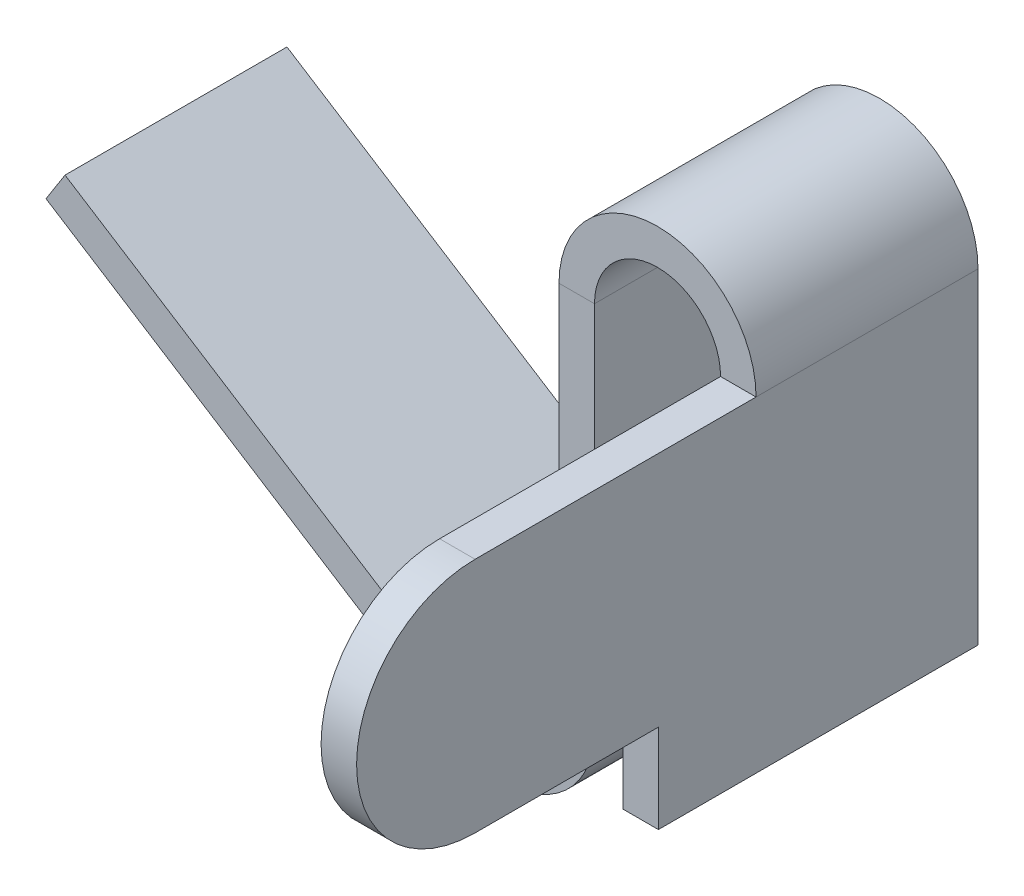
ISO-10303-21;
HEADER;
FILE_DESCRIPTION(('STEP AP214'),'2;1');
FILE_NAME('part.step','',(''),(''),'','','');
FILE_SCHEMA(('AUTOMOTIVE_DESIGN { 1 0 10303 214 1 1 1 1 }'));
ENDSEC;
DATA;
#1=APPLICATION_CONTEXT('core data for automotive mechanical design processes');
#2=APPLICATION_PROTOCOL_DEFINITION('international standard','automotive_design',2000,#1);
#3=PRODUCT_CONTEXT('',#1,'mechanical');
#4=PRODUCT('Part','Part','',(#3));
#5=PRODUCT_RELATED_PRODUCT_CATEGORY('part','',(#4));
#6=PRODUCT_DEFINITION_FORMATION('','',#4);
#7=PRODUCT_DEFINITION_CONTEXT('part definition',#1,'design');
#8=PRODUCT_DEFINITION('design','',#6,#7);
#9=PRODUCT_DEFINITION_SHAPE('','',#8);
#10=(LENGTH_UNIT() NAMED_UNIT(*) SI_UNIT(.MILLI.,.METRE.));
#11=(NAMED_UNIT(*) PLANE_ANGLE_UNIT() SI_UNIT($,.RADIAN.));
#12=(NAMED_UNIT(*) SI_UNIT($,.STERADIAN.) SOLID_ANGLE_UNIT());
#13=UNCERTAINTY_MEASURE_WITH_UNIT(LENGTH_MEASURE(1.E-05),#10,'distance_accuracy_value','');
#14=(GEOMETRIC_REPRESENTATION_CONTEXT(3) GLOBAL_UNCERTAINTY_ASSIGNED_CONTEXT((#13)) GLOBAL_UNIT_ASSIGNED_CONTEXT((#10,
#11,#12)) REPRESENTATION_CONTEXT('',''));
#15=CARTESIAN_POINT('',(0.,0.,0.));
#16=DIRECTION('',(0.,0.,1.));
#17=DIRECTION('',(1.,0.,0.));
#18=AXIS2_PLACEMENT_3D('',#15,#16,#17);
#19=CARTESIAN_POINT('',(1.11,0.5,5.665));
#20=DIRECTION('',(-1.,0.,0.));
#21=DIRECTION('',(0.,-1.,0.));
#22=AXIS2_PLACEMENT_3D('',#19,#20,#21);
#23=CYLINDRICAL_SURFACE('',#22,1.335);
#24=DIRECTION('',(1.,0.,0.));
#25=VECTOR('',#24,1.);
#26=CARTESIAN_POINT('',(1.11,-0.835,5.665));
#27=LINE('',#26,#25);
#28=CARTESIAN_POINT('',(1.11,-0.835,5.665));
#29=VERTEX_POINT('',#28);
#30=CARTESIAN_POINT('',(0.71,-0.835,5.665));
#31=VERTEX_POINT('',#30);
#32=EDGE_CURVE('E283',#29,#31,#27,.F.);
#33=ORIENTED_EDGE('',*,*,#32,.F.);
#34=CARTESIAN_POINT('',(1.11,0.5,5.665));
#35=DIRECTION('',(-1.,0.,0.));
#36=DIRECTION('',(0.,-1.,0.));
#37=AXIS2_PLACEMENT_3D('',#34,#35,#36);
#38=CIRCLE('',#37,1.335);
#39=CARTESIAN_POINT('',(1.11,1.835,5.665));
#40=VERTEX_POINT('',#39);
#41=EDGE_CURVE('E46',#40,#29,#38,.F.);
#42=ORIENTED_EDGE('',*,*,#41,.F.);
#43=DIRECTION('',(1.,0.,0.));
#44=VECTOR('',#43,1.);
#45=CARTESIAN_POINT('',(1.11,1.835,5.665));
#46=LINE('',#45,#44);
#47=CARTESIAN_POINT('',(0.71,1.835,5.665));
#48=VERTEX_POINT('',#47);
#49=EDGE_CURVE('E285',#48,#40,#46,.T.);
#50=ORIENTED_EDGE('',*,*,#49,.F.);
#51=CARTESIAN_POINT('',(0.71,0.5,5.665));
#52=DIRECTION('',(-1.,0.,0.));
#53=DIRECTION('',(0.,-1.,0.));
#54=AXIS2_PLACEMENT_3D('',#51,#52,#53);
#55=CIRCLE('',#54,1.335);
#56=EDGE_CURVE('E11',#31,#48,#55,.T.);
#57=ORIENTED_EDGE('',*,*,#56,.F.);
#58=EDGE_LOOP('',(#33,#42,#50,#57));
#59=FACE_BOUND('',#58,.T.);
#60=ADVANCED_FACE('F38',(#59),#23,.T.);
#61=CARTESIAN_POINT('',(-0.71,1.835,2.5));
#62=DIRECTION('',(0.,0.,1.));
#63=DIRECTION('',(1.,0.,0.));
#64=AXIS2_PLACEMENT_3D('',#61,#62,#63);
#65=PLANE('',#64);
#66=DIRECTION('',(-1.,0.,0.));
#67=VECTOR('',#66,1.);
#68=CARTESIAN_POINT('',(-0.71,1.835,2.5));
#69=LINE('',#68,#67);
#70=CARTESIAN_POINT('',(-0.71,1.835,2.5));
#71=VERTEX_POINT('',#70);
#72=CARTESIAN_POINT('',(-1.11,1.835,2.5));
#73=VERTEX_POINT('',#72);
#74=EDGE_CURVE('E281',#71,#73,#69,.T.);
#75=ORIENTED_EDGE('',*,*,#74,.F.);
#76=CARTESIAN_POINT('',(0.,1.835,2.5));
#77=DIRECTION('',(0.,0.,1.));
#78=DIRECTION('',(1.,0.,0.));
#79=AXIS2_PLACEMENT_3D('',#76,#77,#78);
#80=CIRCLE('',#79,0.71);
#81=CARTESIAN_POINT('',(0.71,1.835,2.5));
#82=VERTEX_POINT('',#81);
#83=EDGE_CURVE('E188',#82,#71,#80,.T.);
#84=ORIENTED_EDGE('',*,*,#83,.F.);
#85=DIRECTION('',(-1.,0.,0.));
#86=VECTOR('',#85,1.);
#87=CARTESIAN_POINT('',(1.11,1.835,2.5));
#88=LINE('',#87,#86);
#89=CARTESIAN_POINT('',(1.11,1.835,2.5));
#90=VERTEX_POINT('',#89);
#91=EDGE_CURVE('E278',#90,#82,#88,.T.);
#92=ORIENTED_EDGE('',*,*,#91,.F.);
#93=CARTESIAN_POINT('',(0.,1.835,2.5));
#94=DIRECTION('',(0.,0.,1.));
#95=DIRECTION('',(1.,0.,0.));
#96=AXIS2_PLACEMENT_3D('',#93,#94,#95);
#97=CIRCLE('',#96,1.11);
#98=EDGE_CURVE('E191',#90,#73,#97,.T.);
#99=ORIENTED_EDGE('',*,*,#98,.T.);
#100=EDGE_LOOP('',(#75,#84,#92,#99));
#101=FACE_BOUND('',#100,.T.);
#102=ADVANCED_FACE('F299',(#101),#65,.T.);
#103=CARTESIAN_POINT('',(1.11,1.835,2.5));
#104=DIRECTION('',(0.,0.,1.));
#105=DIRECTION('',(1.,0.,0.));
#106=AXIS2_PLACEMENT_3D('',#103,#104,#105);
#107=PLANE('',#106);
#108=DIRECTION('',(0.,-1.,0.));
#109=VECTOR('',#108,1.);
#110=CARTESIAN_POINT('',(-0.71,-1.835,2.5));
#111=LINE('',#110,#109);
#112=CARTESIAN_POINT('',(-0.71,-2.335,2.5));
#113=VERTEX_POINT('',#112);
#114=EDGE_CURVE('E185',#71,#113,#111,.T.);
#115=ORIENTED_EDGE('',*,*,#114,.F.);
#116=ORIENTED_EDGE('',*,*,#74,.T.);
#117=DIRECTION('',(0.,-1.,0.));
#118=VECTOR('',#117,1.);
#119=CARTESIAN_POINT('',(-1.11,-1.835,2.5));
#120=LINE('',#119,#118);
#121=CARTESIAN_POINT('',(-1.11,-2.335,2.5));
#122=VERTEX_POINT('',#121);
#123=EDGE_CURVE('E194',#73,#122,#120,.T.);
#124=ORIENTED_EDGE('',*,*,#123,.T.);
#125=DIRECTION('',(1.,0.,0.));
#126=VECTOR('',#125,1.);
#127=CARTESIAN_POINT('',(-1.11,-2.335,2.5));
#128=LINE('',#127,#126);
#129=EDGE_CURVE('E270',#122,#113,#128,.T.);
#130=ORIENTED_EDGE('',*,*,#129,.T.);
#131=EDGE_LOOP('',(#115,#116,#124,#130));
#132=FACE_BOUND('',#131,.T.);
#133=ADVANCED_FACE('F326',(#132),#107,.T.);
#134=CARTESIAN_POINT('',(0.71,1.835,0.));
#135=DIRECTION('',(0.,0.,-1.));
#136=DIRECTION('',(-1.,0.,0.));
#137=AXIS2_PLACEMENT_3D('',#134,#135,#136);
#138=PLANE('',#137);
#139=DIRECTION('',(1.,0.,0.));
#140=VECTOR('',#139,1.);
#141=CARTESIAN_POINT('',(0.71,1.835,0.));
#142=LINE('',#141,#140);
#143=CARTESIAN_POINT('',(0.71,1.835,0.));
#144=VERTEX_POINT('',#143);
#145=CARTESIAN_POINT('',(1.11,1.835,0.));
#146=VERTEX_POINT('',#145);
#147=EDGE_CURVE('E276',#144,#146,#142,.T.);
#148=ORIENTED_EDGE('',*,*,#147,.F.);
#149=CARTESIAN_POINT('',(0.,1.835,0.));
#150=DIRECTION('',(0.,0.,1.));
#151=DIRECTION('',(1.,0.,0.));
#152=AXIS2_PLACEMENT_3D('',#149,#150,#151);
#153=CIRCLE('',#152,0.71);
#154=CARTESIAN_POINT('',(-0.71,1.835,0.));
#155=VERTEX_POINT('',#154);
#156=EDGE_CURVE('E215',#144,#155,#153,.T.);
#157=ORIENTED_EDGE('',*,*,#156,.T.);
#158=DIRECTION('',(1.,0.,0.));
#159=VECTOR('',#158,1.);
#160=CARTESIAN_POINT('',(-1.11,1.835,0.));
#161=LINE('',#160,#159);
#162=CARTESIAN_POINT('',(-1.11,1.835,0.));
#163=VERTEX_POINT('',#162);
#164=EDGE_CURVE('E274',#163,#155,#161,.T.);
#165=ORIENTED_EDGE('',*,*,#164,.F.);
#166=CARTESIAN_POINT('',(0.,1.835,0.));
#167=DIRECTION('',(0.,0.,1.));
#168=DIRECTION('',(1.,0.,0.));
#169=AXIS2_PLACEMENT_3D('',#166,#167,#168);
#170=CIRCLE('',#169,1.11);
#171=EDGE_CURVE('E227',#146,#163,#170,.T.);
#172=ORIENTED_EDGE('',*,*,#171,.F.);
#173=EDGE_LOOP('',(#148,#157,#165,#172));
#174=FACE_BOUND('',#173,.T.);
#175=ADVANCED_FACE('F330',(#174),#138,.T.);
#176=CARTESIAN_POINT('',(-1.11,1.835,0.));
#177=DIRECTION('',(0.,0.,-1.));
#178=DIRECTION('',(-1.,0.,0.));
#179=AXIS2_PLACEMENT_3D('',#176,#177,#178);
#180=PLANE('',#179);
#181=DIRECTION('',(0.,1.,0.));
#182=VECTOR('',#181,1.);
#183=CARTESIAN_POINT('',(0.71,-1.835,0.));
#184=LINE('',#183,#182);
#185=CARTESIAN_POINT('',(0.71,-1.835,0.));
#186=VERTEX_POINT('',#185);
#187=EDGE_CURVE('E218',#186,#144,#184,.T.);
#188=ORIENTED_EDGE('',*,*,#187,.T.);
#189=ORIENTED_EDGE('',*,*,#147,.T.);
#190=DIRECTION('',(0.,1.,0.));
#191=VECTOR('',#190,1.);
#192=CARTESIAN_POINT('',(1.11,-1.835,0.));
#193=LINE('',#192,#191);
#194=CARTESIAN_POINT('',(1.11,-1.835,0.));
#195=VERTEX_POINT('',#194);
#196=EDGE_CURVE('E224',#195,#146,#193,.T.);
#197=ORIENTED_EDGE('',*,*,#196,.F.);
#198=DIRECTION('',(-1.,0.,0.));
#199=VECTOR('',#198,1.);
#200=CARTESIAN_POINT('',(1.11,-1.835,0.));
#201=LINE('',#200,#199);
#202=EDGE_CURVE('E221',#195,#186,#201,.T.);
#203=ORIENTED_EDGE('',*,*,#202,.T.);
#204=EDGE_LOOP('',(#188,#189,#197,#203));
#205=FACE_BOUND('',#204,.T.);
#206=ADVANCED_FACE('F311',(#205),#180,.T.);
#207=CARTESIAN_POINT('',(-2.24626881057681,-3.17904725152241,2.5));
#208=DIRECTION('',(0.,0.,1.));
#209=DIRECTION('',(1.,0.,0.));
#210=AXIS2_PLACEMENT_3D('',#207,#208,#209);
#211=PLANE('',#210);
#212=DIRECTION('',(0.536268810576813,0.844047251522407,0.));
#213=VECTOR('',#212,1.);
#214=CARTESIAN_POINT('',(-2.24626881057681,-3.17904725152241,2.5));
#215=LINE('',#214,#213);
#216=CARTESIAN_POINT('',(-2.24626881057681,-3.17904725152241,2.5));
#217=VERTEX_POINT('',#216);
#218=CARTESIAN_POINT('',(-2.03176128634609,-2.84142835091344,2.5));
#219=VERTEX_POINT('',#218);
#220=EDGE_CURVE('E272',#217,#219,#215,.T.);
#221=ORIENTED_EDGE('',*,*,#220,.F.);
#222=CARTESIAN_POINT('',(-1.71,-2.335,2.5));
#223=DIRECTION('',(0.,0.,-1.));
#224=DIRECTION('',(-1.,0.,0.));
#225=AXIS2_PLACEMENT_3D('',#222,#223,#224);
#226=CIRCLE('',#225,1.);
#227=EDGE_CURVE('E182',#113,#217,#226,.T.);
#228=ORIENTED_EDGE('',*,*,#227,.F.);
#229=ORIENTED_EDGE('',*,*,#129,.F.);
#230=CARTESIAN_POINT('',(-1.71,-2.335,2.5));
#231=DIRECTION('',(0.,0.,1.));
#232=DIRECTION('',(1.,0.,0.));
#233=AXIS2_PLACEMENT_3D('',#230,#231,#232);
#234=CIRCLE('',#233,0.6);
#235=EDGE_CURVE('E197',#122,#219,#234,.F.);
#236=ORIENTED_EDGE('',*,*,#235,.T.);
#237=EDGE_LOOP('',(#221,#228,#229,#236));
#238=FACE_BOUND('',#237,.T.);
#239=ADVANCED_FACE('F339',(#238),#211,.T.);
#240=CARTESIAN_POINT('',(-1.11,-2.335,2.5));
#241=DIRECTION('',(0.,0.,1.));
#242=DIRECTION('',(1.,0.,0.));
#243=AXIS2_PLACEMENT_3D('',#240,#241,#242);
#244=PLANE('',#243);
#245=DIRECTION('',(-0.844047251522407,0.536268810576813,0.));
#246=VECTOR('',#245,1.);
#247=CARTESIAN_POINT('',(-2.24626881057681,-3.17904725152241,2.5));
#248=LINE('',#247,#246);
#249=CARTESIAN_POINT('',(-6.88852869395005,-0.229568793349934,2.5));
#250=VERTEX_POINT('',#249);
#251=EDGE_CURVE('E179',#217,#250,#248,.T.);
#252=ORIENTED_EDGE('',*,*,#251,.F.);
#253=ORIENTED_EDGE('',*,*,#220,.T.);
#254=DIRECTION('',(-0.844047251522407,0.536268810576813,0.));
#255=VECTOR('',#254,1.);
#256=CARTESIAN_POINT('',(-2.03176128634609,-2.84142835091344,2.5));
#257=LINE('',#256,#255);
#258=CARTESIAN_POINT('',(-6.67402116971933,0.108050107259028,2.5));
#259=VERTEX_POINT('',#258);
#260=EDGE_CURVE('E173',#219,#259,#257,.T.);
#261=ORIENTED_EDGE('',*,*,#260,.T.);
#262=DIRECTION('',(0.536268810576813,0.844047251522408,0.));
#263=VECTOR('',#262,1.);
#264=CARTESIAN_POINT('',(-6.88852869395005,-0.229568793349934,2.5));
#265=LINE('',#264,#263);
#266=EDGE_CURVE('E175',#250,#259,#265,.T.);
#267=ORIENTED_EDGE('',*,*,#266,.F.);
#268=EDGE_LOOP('',(#252,#253,#261,#267));
#269=FACE_BOUND('',#268,.T.);
#270=ADVANCED_FACE('F342',(#269),#244,.T.);
#271=CARTESIAN_POINT('',(-0.71,-2.335,0.));
#272=DIRECTION('',(0.,0.,-1.));
#273=DIRECTION('',(-1.,0.,0.));
#274=AXIS2_PLACEMENT_3D('',#271,#272,#273);
#275=PLANE('',#274);
#276=DIRECTION('',(-1.,0.,0.));
#277=VECTOR('',#276,1.);
#278=CARTESIAN_POINT('',(-0.71,-2.335,0.));
#279=LINE('',#278,#277);
#280=CARTESIAN_POINT('',(-0.71,-2.335,0.));
#281=VERTEX_POINT('',#280);
#282=CARTESIAN_POINT('',(-1.11,-2.335,0.));
#283=VERTEX_POINT('',#282);
#284=EDGE_CURVE('E268',#281,#283,#279,.T.);
#285=ORIENTED_EDGE('',*,*,#284,.F.);
#286=CARTESIAN_POINT('',(-1.71,-2.335,0.));
#287=DIRECTION('',(0.,0.,-1.));
#288=DIRECTION('',(-1.,0.,0.));
#289=AXIS2_PLACEMENT_3D('',#286,#287,#288);
#290=CIRCLE('',#289,1.);
#291=CARTESIAN_POINT('',(-2.24626881057681,-3.17904725152241,0.));
#292=VERTEX_POINT('',#291);
#293=EDGE_CURVE('E209',#281,#292,#290,.T.);
#294=ORIENTED_EDGE('',*,*,#293,.T.);
#295=DIRECTION('',(-0.536268810576813,-0.844047251522407,0.));
#296=VECTOR('',#295,1.);
#297=CARTESIAN_POINT('',(-2.03176128634609,-2.84142835091344,0.));
#298=LINE('',#297,#296);
#299=CARTESIAN_POINT('',(-2.03176128634609,-2.84142835091344,0.));
#300=VERTEX_POINT('',#299);
#301=EDGE_CURVE('E266',#300,#292,#298,.T.);
#302=ORIENTED_EDGE('',*,*,#301,.F.);
#303=CARTESIAN_POINT('',(-1.71,-2.335,0.));
#304=DIRECTION('',(0.,0.,1.));
#305=DIRECTION('',(1.,0.,0.));
#306=AXIS2_PLACEMENT_3D('',#303,#304,#305);
#307=CIRCLE('',#306,0.6);
#308=EDGE_CURVE('E176',#283,#300,#307,.F.);
#309=ORIENTED_EDGE('',*,*,#308,.F.);
#310=EDGE_LOOP('',(#285,#294,#302,#309));
#311=FACE_BOUND('',#310,.T.);
#312=ADVANCED_FACE('F346',(#311),#275,.T.);
#313=CARTESIAN_POINT('',(-2.03176128634609,-2.84142835091344,0.));
#314=DIRECTION('',(0.,0.,-1.));
#315=DIRECTION('',(-1.,0.,0.));
#316=AXIS2_PLACEMENT_3D('',#313,#314,#315);
#317=PLANE('',#316);
#318=DIRECTION('',(0.,-1.,0.));
#319=VECTOR('',#318,1.);
#320=CARTESIAN_POINT('',(-0.71,-1.835,0.));
#321=LINE('',#320,#319);
#322=EDGE_CURVE('E212',#155,#281,#321,.T.);
#323=ORIENTED_EDGE('',*,*,#322,.T.);
#324=ORIENTED_EDGE('',*,*,#284,.T.);
#325=DIRECTION('',(0.,1.,0.));
#326=VECTOR('',#325,1.);
#327=CARTESIAN_POINT('',(-1.11,-1.835,0.));
#328=LINE('',#327,#326);
#329=EDGE_CURVE('E230',#163,#283,#328,.F.);
#330=ORIENTED_EDGE('',*,*,#329,.F.);
#331=ORIENTED_EDGE('',*,*,#164,.T.);
#332=EDGE_LOOP('',(#323,#324,#330,#331));
#333=FACE_BOUND('',#332,.T.);
#334=ADVANCED_FACE('F350',(#333),#317,.T.);
#335=CARTESIAN_POINT('',(-2.03176128634609,-2.84142835091344,2.5));
#336=DIRECTION('',(-0.536268810576813,-0.844047251522407,0.));
#337=DIRECTION('',(0.844047251522407,-0.536268810576813,0.));
#338=AXIS2_PLACEMENT_3D('',#335,#336,#337);
#339=PLANE('',#338);
#340=DIRECTION('',(-0.844047251522407,0.536268810576813,0.));
#341=VECTOR('',#340,1.);
#342=CARTESIAN_POINT('',(-2.03176128634609,-2.84142835091344,0.));
#343=LINE('',#342,#341);
#344=CARTESIAN_POINT('',(-6.67402116971933,0.108050107259028,0.));
#345=VERTEX_POINT('',#344);
#346=EDGE_CURVE('E172',#300,#345,#343,.T.);
#347=ORIENTED_EDGE('',*,*,#346,.T.);
#348=DIRECTION('',(0.,0.,-1.));
#349=VECTOR('',#348,1.);
#350=CARTESIAN_POINT('',(-6.67402116971933,0.108050107259028,2.5));
#351=LINE('',#350,#349);
#352=EDGE_CURVE('E264',#259,#345,#351,.T.);
#353=ORIENTED_EDGE('',*,*,#352,.F.);
#354=ORIENTED_EDGE('',*,*,#260,.F.);
#355=DIRECTION('',(0.,0.,-1.));
#356=VECTOR('',#355,1.);
#357=CARTESIAN_POINT('',(-2.03176128634609,-2.84142835091344,2.5));
#358=LINE('',#357,#356);
#359=EDGE_CURVE('E200',#219,#300,#358,.T.);
#360=ORIENTED_EDGE('',*,*,#359,.T.);
#361=EDGE_LOOP('',(#347,#353,#354,#360));
#362=FACE_BOUND('',#361,.T.);
#363=ADVANCED_FACE('F354',(#362),#339,.F.);
#364=CARTESIAN_POINT('',(-6.88852869395005,-0.229568793349934,2.5));
#365=DIRECTION('',(-0.844047251522408,0.536268810576813,0.));
#366=DIRECTION('',(-0.536268810576813,-0.844047251522408,0.));
#367=AXIS2_PLACEMENT_3D('',#364,#365,#366);
#368=PLANE('',#367);
#369=DIRECTION('',(0.536268810576813,0.844047251522408,0.));
#370=VECTOR('',#369,1.);
#371=CARTESIAN_POINT('',(-6.88852869395005,-0.229568793349934,0.));
#372=LINE('',#371,#370);
#373=CARTESIAN_POINT('',(-6.88852869395005,-0.229568793349934,0.));
#374=VERTEX_POINT('',#373);
#375=EDGE_CURVE('E203',#374,#345,#372,.T.);
#376=ORIENTED_EDGE('',*,*,#375,.F.);
#377=DIRECTION('',(0.,0.,-1.));
#378=VECTOR('',#377,1.);
#379=CARTESIAN_POINT('',(-6.88852869395005,-0.229568793349934,2.5));
#380=LINE('',#379,#378);
#381=EDGE_CURVE('E262',#250,#374,#380,.T.);
#382=ORIENTED_EDGE('',*,*,#381,.F.);
#383=ORIENTED_EDGE('',*,*,#266,.T.);
#384=ORIENTED_EDGE('',*,*,#352,.T.);
#385=EDGE_LOOP('',(#376,#382,#383,#384));
#386=FACE_BOUND('',#385,.T.);
#387=ADVANCED_FACE('F358',(#386),#368,.T.);
#388=CARTESIAN_POINT('',(-2.24626881057681,-3.17904725152241,2.5));
#389=DIRECTION('',(-0.536268810576813,-0.844047251522407,0.));
#390=DIRECTION('',(0.844047251522407,-0.536268810576813,0.));
#391=AXIS2_PLACEMENT_3D('',#388,#389,#390);
#392=PLANE('',#391);
#393=DIRECTION('',(-0.844047251522407,0.536268810576813,0.));
#394=VECTOR('',#393,1.);
#395=CARTESIAN_POINT('',(-2.24626881057681,-3.17904725152241,0.));
#396=LINE('',#395,#394);
#397=EDGE_CURVE('E206',#292,#374,#396,.T.);
#398=ORIENTED_EDGE('',*,*,#397,.F.);
#399=DIRECTION('',(0.,0.,-1.));
#400=VECTOR('',#399,1.);
#401=CARTESIAN_POINT('',(-2.24626881057681,-3.17904725152241,2.5));
#402=LINE('',#401,#400);
#403=EDGE_CURVE('E259',#217,#292,#402,.T.);
#404=ORIENTED_EDGE('',*,*,#403,.F.);
#405=ORIENTED_EDGE('',*,*,#251,.T.);
#406=ORIENTED_EDGE('',*,*,#381,.T.);
#407=EDGE_LOOP('',(#398,#404,#405,#406));
#408=FACE_BOUND('',#407,.T.);
#409=ADVANCED_FACE('F362',(#408),#392,.T.);
#410=CARTESIAN_POINT('',(-1.71,-2.335,2.5));
#411=DIRECTION('',(0.,0.,-1.));
#412=DIRECTION('',(-1.,0.,0.));
#413=AXIS2_PLACEMENT_3D('',#410,#411,#412);
#414=CYLINDRICAL_SURFACE('',#413,1.);
#415=ORIENTED_EDGE('',*,*,#293,.F.);
#416=DIRECTION('',(0.,0.,-1.));
#417=VECTOR('',#416,1.);
#418=CARTESIAN_POINT('',(-0.71,-2.335,2.5));
#419=LINE('',#418,#417);
#420=EDGE_CURVE('E256',#113,#281,#419,.T.);
#421=ORIENTED_EDGE('',*,*,#420,.F.);
#422=ORIENTED_EDGE('',*,*,#227,.T.);
#423=ORIENTED_EDGE('',*,*,#403,.T.);
#424=EDGE_LOOP('',(#415,#421,#422,#423));
#425=FACE_BOUND('',#424,.T.);
#426=ADVANCED_FACE('F366',(#425),#414,.T.);
#427=CARTESIAN_POINT('',(-0.71,-1.835,2.5));
#428=DIRECTION('',(1.,0.,0.));
#429=DIRECTION('',(0.,1.,0.));
#430=AXIS2_PLACEMENT_3D('',#427,#428,#429);
#431=PLANE('',#430);
#432=ORIENTED_EDGE('',*,*,#322,.F.);
#433=DIRECTION('',(0.,0.,-1.));
#434=VECTOR('',#433,1.);
#435=CARTESIAN_POINT('',(-0.71,1.835,2.5));
#436=LINE('',#435,#434);
#437=EDGE_CURVE('E253',#71,#155,#436,.T.);
#438=ORIENTED_EDGE('',*,*,#437,.F.);
#439=ORIENTED_EDGE('',*,*,#114,.T.);
#440=ORIENTED_EDGE('',*,*,#420,.T.);
#441=EDGE_LOOP('',(#432,#438,#439,#440));
#442=FACE_BOUND('',#441,.T.);
#443=ADVANCED_FACE('F370',(#442),#431,.T.);
#444=CARTESIAN_POINT('',(0.,1.835,2.5));
#445=DIRECTION('',(0.,0.,-1.));
#446=DIRECTION('',(-1.,0.,0.));
#447=AXIS2_PLACEMENT_3D('',#444,#445,#446);
#448=CYLINDRICAL_SURFACE('',#447,0.71);
#449=ORIENTED_EDGE('',*,*,#156,.F.);
#450=DIRECTION('',(0.,0.,-1.));
#451=VECTOR('',#450,1.);
#452=CARTESIAN_POINT('',(0.71,1.835,2.5));
#453=LINE('',#452,#451);
#454=EDGE_CURVE('E250',#82,#144,#453,.T.);
#455=ORIENTED_EDGE('',*,*,#454,.F.);
#456=ORIENTED_EDGE('',*,*,#83,.T.);
#457=ORIENTED_EDGE('',*,*,#437,.T.);
#458=EDGE_LOOP('',(#449,#455,#456,#457));
#459=FACE_BOUND('',#458,.T.);
#460=ADVANCED_FACE('F305',(#459),#448,.F.);
#461=CARTESIAN_POINT('',(0.71,-1.835,2.5));
#462=DIRECTION('',(-1.,0.,0.));
#463=DIRECTION('',(0.,-1.,0.));
#464=AXIS2_PLACEMENT_3D('',#461,#462,#463);
#465=PLANE('',#464);
#466=DIRECTION('',(0.,0.,-1.));
#467=VECTOR('',#466,1.);
#468=CARTESIAN_POINT('',(0.71,-0.835,2.5));
#469=LINE('',#468,#467);
#470=CARTESIAN_POINT('',(0.71,-0.835,3.6));
#471=VERTEX_POINT('',#470);
#472=EDGE_CURVE('E148',#31,#471,#469,.T.);
#473=ORIENTED_EDGE('',*,*,#472,.F.);
#474=ORIENTED_EDGE('',*,*,#56,.T.);
#475=DIRECTION('',(0.,0.,-1.));
#476=VECTOR('',#475,1.);
#477=CARTESIAN_POINT('',(0.71,1.835,7.));
#478=LINE('',#477,#476);
#479=EDGE_CURVE('E168',#48,#82,#478,.T.);
#480=ORIENTED_EDGE('',*,*,#479,.T.);
#481=ORIENTED_EDGE('',*,*,#454,.T.);
#482=ORIENTED_EDGE('',*,*,#187,.F.);
#483=DIRECTION('',(0.,0.,-1.));
#484=VECTOR('',#483,1.);
#485=CARTESIAN_POINT('',(0.71,-1.835,2.5));
#486=LINE('',#485,#484);
#487=CARTESIAN_POINT('',(0.710000000000001,-1.835,3.6));
#488=VERTEX_POINT('',#487);
#489=EDGE_CURVE('E248',#488,#186,#486,.T.);
#490=ORIENTED_EDGE('',*,*,#489,.F.);
#491=DIRECTION('',(0.,-1.,0.));
#492=VECTOR('',#491,1.);
#493=CARTESIAN_POINT('',(0.71,-1.835,3.6));
#494=LINE('',#493,#492);
#495=EDGE_CURVE('E166',#471,#488,#494,.T.);
#496=ORIENTED_EDGE('',*,*,#495,.F.);
#497=EDGE_LOOP('',(#473,#474,#480,#481,#482,#490,#496));
#498=FACE_BOUND('',#497,.T.);
#499=ADVANCED_FACE('F307',(#498),#465,.T.);
#500=CARTESIAN_POINT('',(1.11,-1.835,2.5));
#501=DIRECTION('',(0.,-1.,0.));
#502=DIRECTION('',(0.,0.,-1.));
#503=AXIS2_PLACEMENT_3D('',#500,#501,#502);
#504=PLANE('',#503);
#505=DIRECTION('',(1.,0.,0.));
#506=VECTOR('',#505,1.);
#507=CARTESIAN_POINT('',(-6.88852869395005,-1.835,3.6));
#508=LINE('',#507,#506);
#509=CARTESIAN_POINT('',(1.11,-1.835,3.6));
#510=VERTEX_POINT('',#509);
#511=EDGE_CURVE('E151',#488,#510,#508,.T.);
#512=ORIENTED_EDGE('',*,*,#511,.F.);
#513=ORIENTED_EDGE('',*,*,#489,.T.);
#514=ORIENTED_EDGE('',*,*,#202,.F.);
#515=DIRECTION('',(0.,0.,-1.));
#516=VECTOR('',#515,1.);
#517=CARTESIAN_POINT('',(1.11,-1.835,2.5));
#518=LINE('',#517,#516);
#519=EDGE_CURVE('E246',#510,#195,#518,.T.);
#520=ORIENTED_EDGE('',*,*,#519,.F.);
#521=EDGE_LOOP('',(#512,#513,#514,#520));
#522=FACE_BOUND('',#521,.T.);
#523=ADVANCED_FACE('F313',(#522),#504,.T.);
#524=CARTESIAN_POINT('',(1.11,-1.835,2.5));
#525=DIRECTION('',(-1.,0.,0.));
#526=DIRECTION('',(0.,-1.,0.));
#527=AXIS2_PLACEMENT_3D('',#524,#525,#526);
#528=PLANE('',#527);
#529=DIRECTION('',(0.,0.,-1.));
#530=VECTOR('',#529,1.);
#531=CARTESIAN_POINT('',(1.11,1.835,7.));
#532=LINE('',#531,#530);
#533=EDGE_CURVE('E170',#40,#90,#532,.T.);
#534=ORIENTED_EDGE('',*,*,#533,.F.);
#535=ORIENTED_EDGE('',*,*,#41,.T.);
#536=DIRECTION('',(0.,0.,1.));
#537=VECTOR('',#536,1.);
#538=CARTESIAN_POINT('',(1.11,-0.835,7.));
#539=LINE('',#538,#537);
#540=CARTESIAN_POINT('',(1.11,-0.835,3.6));
#541=VERTEX_POINT('',#540);
#542=EDGE_CURVE('E147',#541,#29,#539,.T.);
#543=ORIENTED_EDGE('',*,*,#542,.F.);
#544=DIRECTION('',(0.,1.,0.));
#545=VECTOR('',#544,1.);
#546=CARTESIAN_POINT('',(1.11,-0.835,3.6));
#547=LINE('',#546,#545);
#548=EDGE_CURVE('E154',#510,#541,#547,.T.);
#549=ORIENTED_EDGE('',*,*,#548,.F.);
#550=ORIENTED_EDGE('',*,*,#519,.T.);
#551=ORIENTED_EDGE('',*,*,#196,.T.);
#552=DIRECTION('',(0.,0.,-1.));
#553=VECTOR('',#552,1.);
#554=CARTESIAN_POINT('',(1.11,1.835,2.5));
#555=LINE('',#554,#553);
#556=EDGE_CURVE('E243',#90,#146,#555,.T.);
#557=ORIENTED_EDGE('',*,*,#556,.F.);
#558=EDGE_LOOP('',(#534,#535,#543,#549,#550,#551,#557));
#559=FACE_BOUND('',#558,.T.);
#560=ADVANCED_FACE('F161',(#559),#528,.F.);
#561=CARTESIAN_POINT('',(0.,1.835,2.5));
#562=DIRECTION('',(0.,0.,-1.));
#563=DIRECTION('',(-1.,0.,0.));
#564=AXIS2_PLACEMENT_3D('',#561,#562,#563);
#565=CYLINDRICAL_SURFACE('',#564,1.11);
#566=ORIENTED_EDGE('',*,*,#171,.T.);
#567=DIRECTION('',(0.,0.,-1.));
#568=VECTOR('',#567,1.);
#569=CARTESIAN_POINT('',(-1.11,1.835,2.5));
#570=LINE('',#569,#568);
#571=EDGE_CURVE('E240',#73,#163,#570,.T.);
#572=ORIENTED_EDGE('',*,*,#571,.F.);
#573=ORIENTED_EDGE('',*,*,#98,.F.);
#574=ORIENTED_EDGE('',*,*,#556,.T.);
#575=EDGE_LOOP('',(#566,#572,#573,#574));
#576=FACE_BOUND('',#575,.T.);
#577=ADVANCED_FACE('F296',(#576),#565,.T.);
#578=CARTESIAN_POINT('',(-1.11,-1.835,2.5));
#579=DIRECTION('',(1.,0.,0.));
#580=DIRECTION('',(0.,0.,-1.));
#581=AXIS2_PLACEMENT_3D('',#578,#579,#580);
#582=PLANE('',#581);
#583=ORIENTED_EDGE('',*,*,#329,.T.);
#584=DIRECTION('',(0.,0.,-1.));
#585=VECTOR('',#584,1.);
#586=CARTESIAN_POINT('',(-1.11,-2.335,2.5));
#587=LINE('',#586,#585);
#588=EDGE_CURVE('E237',#122,#283,#587,.T.);
#589=ORIENTED_EDGE('',*,*,#588,.F.);
#590=ORIENTED_EDGE('',*,*,#123,.F.);
#591=ORIENTED_EDGE('',*,*,#571,.T.);
#592=EDGE_LOOP('',(#583,#589,#590,#591));
#593=FACE_BOUND('',#592,.T.);
#594=ADVANCED_FACE('F436',(#593),#582,.F.);
#595=CARTESIAN_POINT('',(-1.71,-2.335,2.5));
#596=DIRECTION('',(0.,0.,-1.));
#597=DIRECTION('',(-1.,0.,0.));
#598=AXIS2_PLACEMENT_3D('',#595,#596,#597);
#599=CYLINDRICAL_SURFACE('',#598,0.6);
#600=ORIENTED_EDGE('',*,*,#308,.T.);
#601=ORIENTED_EDGE('',*,*,#359,.F.);
#602=ORIENTED_EDGE('',*,*,#235,.F.);
#603=ORIENTED_EDGE('',*,*,#588,.T.);
#604=EDGE_LOOP('',(#600,#601,#602,#603));
#605=FACE_BOUND('',#604,.T.);
#606=ADVANCED_FACE('F447',(#605),#599,.F.);
#607=CARTESIAN_POINT('',(-1.71,-2.335,0.));
#608=DIRECTION('',(0.,0.,-1.));
#609=DIRECTION('',(-1.,0.,0.));
#610=AXIS2_PLACEMENT_3D('',#607,#608,#609);
#611=PLANE('',#610);
#612=ORIENTED_EDGE('',*,*,#346,.F.);
#613=ORIENTED_EDGE('',*,*,#301,.T.);
#614=ORIENTED_EDGE('',*,*,#397,.T.);
#615=ORIENTED_EDGE('',*,*,#375,.T.);
#616=EDGE_LOOP('',(#612,#613,#614,#615));
#617=FACE_BOUND('',#616,.T.);
#618=ADVANCED_FACE('F408',(#617),#611,.T.);
#619=CARTESIAN_POINT('',(1.11,1.835,7.));
#620=DIRECTION('',(0.,-1.,0.));
#621=DIRECTION('',(0.,0.,-1.));
#622=AXIS2_PLACEMENT_3D('',#619,#620,#621);
#623=PLANE('',#622);
#624=ORIENTED_EDGE('',*,*,#479,.F.);
#625=ORIENTED_EDGE('',*,*,#49,.T.);
#626=ORIENTED_EDGE('',*,*,#533,.T.);
#627=ORIENTED_EDGE('',*,*,#91,.T.);
#628=EDGE_LOOP('',(#624,#625,#626,#627));
#629=FACE_BOUND('',#628,.T.);
#630=ADVANCED_FACE('F288',(#629),#623,.F.);
#631=CARTESIAN_POINT('',(-6.88852869395005,-0.835000000000001,3.6));
#632=DIRECTION('',(0.,0.,-1.));
#633=DIRECTION('',(-1.,0.,0.));
#634=AXIS2_PLACEMENT_3D('',#631,#632,#633);
#635=PLANE('',#634);
#636=ORIENTED_EDGE('',*,*,#495,.T.);
#637=ORIENTED_EDGE('',*,*,#511,.T.);
#638=ORIENTED_EDGE('',*,*,#548,.T.);
#639=DIRECTION('',(1.,0.,0.));
#640=VECTOR('',#639,1.);
#641=CARTESIAN_POINT('',(-6.88852869395005,-0.835000000000001,3.6));
#642=LINE('',#641,#640);
#643=EDGE_CURVE('E142',#471,#541,#642,.T.);
#644=ORIENTED_EDGE('',*,*,#643,.F.);
#645=EDGE_LOOP('',(#636,#637,#638,#644));
#646=FACE_BOUND('',#645,.T.);
#647=ADVANCED_FACE('F155',(#646),#635,.F.);
#648=CARTESIAN_POINT('',(-6.88852869395005,-0.835000000000001,7.));
#649=DIRECTION('',(0.,1.,0.));
#650=DIRECTION('',(-1.,0.,0.));
#651=AXIS2_PLACEMENT_3D('',#648,#649,#650);
#652=PLANE('',#651);
#653=ORIENTED_EDGE('',*,*,#542,.T.);
#654=ORIENTED_EDGE('',*,*,#32,.T.);
#655=ORIENTED_EDGE('',*,*,#472,.T.);
#656=ORIENTED_EDGE('',*,*,#643,.T.);
#657=EDGE_LOOP('',(#653,#654,#655,#656));
#658=FACE_BOUND('',#657,.T.);
#659=ADVANCED_FACE('F144',(#658),#652,.F.);
#660=CLOSED_SHELL('',(#60,#102,#133,#175,#206,#239,#270,#312,#334,#363,#387,#409,#426,#443,#460,
#499,#523,#560,#577,#594,#606,#618,#630,#647,#659));
#661=MANIFOLD_SOLID_BREP('B2',#660);
#662=ADVANCED_BREP_SHAPE_REPRESENTATION('',(#18,#661),#14);
#663=SHAPE_DEFINITION_REPRESENTATION(#9,#662);
ENDSEC;
END-ISO-10303-21;
